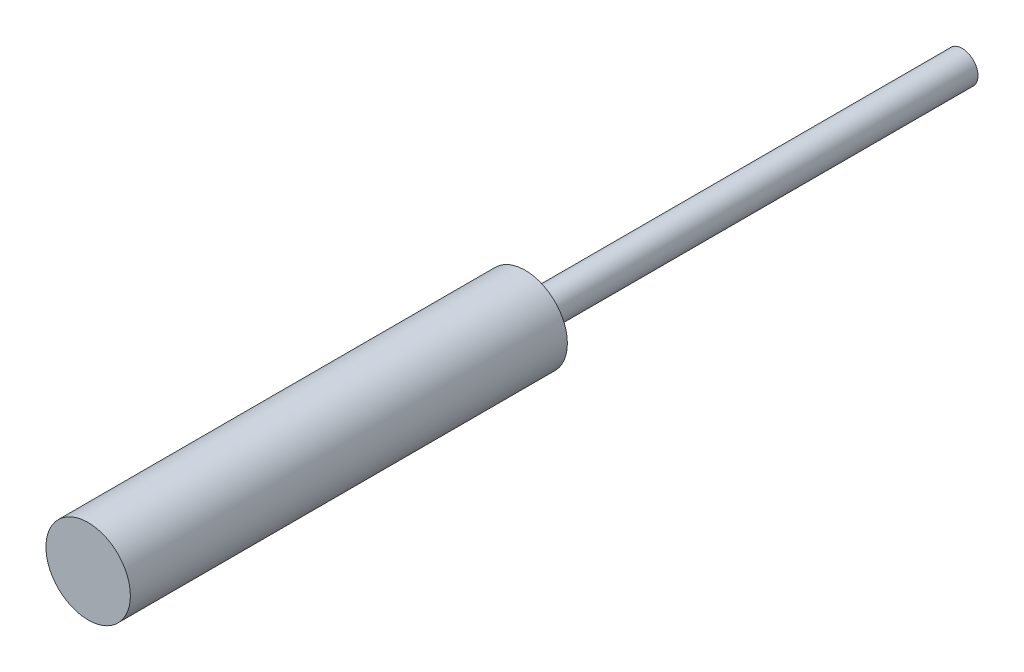
ISO-10303-21;
HEADER;
FILE_DESCRIPTION(('STEP AP214'),'2;1');
FILE_NAME('part.step','',(''),(''),'','','');
FILE_SCHEMA(('AUTOMOTIVE_DESIGN { 1 0 10303 214 1 1 1 1 }'));
ENDSEC;
DATA;
#1=APPLICATION_CONTEXT('core data for automotive mechanical design processes');
#2=APPLICATION_PROTOCOL_DEFINITION('international standard','automotive_design',2000,#1);
#3=PRODUCT_CONTEXT('',#1,'mechanical');
#4=PRODUCT('Part','Part','',(#3));
#5=PRODUCT_RELATED_PRODUCT_CATEGORY('part','',(#4));
#6=PRODUCT_DEFINITION_FORMATION('','',#4);
#7=PRODUCT_DEFINITION_CONTEXT('part definition',#1,'design');
#8=PRODUCT_DEFINITION('design','',#6,#7);
#9=PRODUCT_DEFINITION_SHAPE('','',#8);
#10=(LENGTH_UNIT() NAMED_UNIT(*) SI_UNIT(.MILLI.,.METRE.));
#11=(NAMED_UNIT(*) PLANE_ANGLE_UNIT() SI_UNIT($,.RADIAN.));
#12=(NAMED_UNIT(*) SI_UNIT($,.STERADIAN.) SOLID_ANGLE_UNIT());
#13=UNCERTAINTY_MEASURE_WITH_UNIT(LENGTH_MEASURE(1.E-05),#10,'distance_accuracy_value','');
#14=(GEOMETRIC_REPRESENTATION_CONTEXT(3) GLOBAL_UNCERTAINTY_ASSIGNED_CONTEXT((#13)) GLOBAL_UNIT_ASSIGNED_CONTEXT((#10,
#11,#12)) REPRESENTATION_CONTEXT('',''));
#15=CARTESIAN_POINT('',(0.,0.,0.));
#16=DIRECTION('',(0.,0.,1.));
#17=DIRECTION('',(1.,0.,0.));
#18=AXIS2_PLACEMENT_3D('',#15,#16,#17);
#19=CARTESIAN_POINT('',(0.,0.,20.7));
#20=DIRECTION('',(0.,0.,-1.));
#21=DIRECTION('',(-1.,0.,0.));
#22=AXIS2_PLACEMENT_3D('',#19,#20,#21);
#23=CYLINDRICAL_SURFACE('',#22,2.);
#24=CARTESIAN_POINT('',(0.,0.,20.7));
#25=DIRECTION('',(0.,0.,1.));
#26=DIRECTION('',(1.,0.,0.));
#27=AXIS2_PLACEMENT_3D('',#24,#25,#26);
#28=CIRCLE('',#27,2.);
#29=CARTESIAN_POINT('',(2.,0.,20.7));
#30=VERTEX_POINT('',#29);
#31=EDGE_CURVE('E41',#30,#30,#28,.T.);
#32=ORIENTED_EDGE('',*,*,#31,.F.);
#33=EDGE_LOOP('',(#32));
#34=FACE_BOUND('',#33,.T.);
#35=CARTESIAN_POINT('',(0.,0.,0.));
#36=DIRECTION('',(0.,0.,1.));
#37=DIRECTION('',(1.,0.,0.));
#38=AXIS2_PLACEMENT_3D('',#35,#36,#37);
#39=CIRCLE('',#38,2.);
#40=CARTESIAN_POINT('',(2.,0.,0.));
#41=VERTEX_POINT('',#40);
#42=EDGE_CURVE('E45',#41,#41,#39,.T.);
#43=ORIENTED_EDGE('',*,*,#42,.T.);
#44=EDGE_LOOP('',(#43));
#45=FACE_BOUND('',#44,.T.);
#46=ADVANCED_FACE('F35',(#34,#45),#23,.T.);
#47=CARTESIAN_POINT('',(0.,0.,20.7));
#48=DIRECTION('',(0.,0.,1.));
#49=DIRECTION('',(1.,0.,0.));
#50=AXIS2_PLACEMENT_3D('',#47,#48,#49);
#51=PLANE('',#50);
#52=ORIENTED_EDGE('',*,*,#31,.T.);
#53=EDGE_LOOP('',(#52));
#54=FACE_BOUND('',#53,.T.);
#55=ADVANCED_FACE('F66',(#54),#51,.T.);
#56=CARTESIAN_POINT('',(0.,0.,0.));
#57=DIRECTION('',(0.,0.,1.));
#58=DIRECTION('',(1.,0.,0.));
#59=AXIS2_PLACEMENT_3D('',#56,#57,#58);
#60=PLANE('',#59);
#61=CARTESIAN_POINT('',(0.,0.,0.));
#62=DIRECTION('',(0.,0.,1.));
#63=DIRECTION('',(1.,0.,0.));
#64=AXIS2_PLACEMENT_3D('',#61,#62,#63);
#65=CIRCLE('',#64,0.75);
#66=CARTESIAN_POINT('',(0.75,0.,0.));
#67=VERTEX_POINT('',#66);
#68=EDGE_CURVE('E10',#67,#67,#65,.F.);
#69=ORIENTED_EDGE('',*,*,#68,.F.);
#70=EDGE_LOOP('',(#69));
#71=FACE_BOUND('',#70,.T.);
#72=ORIENTED_EDGE('',*,*,#42,.F.);
#73=EDGE_LOOP('',(#72));
#74=FACE_BOUND('',#73,.T.);
#75=ADVANCED_FACE('F59',(#71,#74),#60,.F.);
#76=CARTESIAN_POINT('',(0.,0.,-20.7));
#77=DIRECTION('',(0.,0.,1.));
#78=DIRECTION('',(1.,0.,0.));
#79=AXIS2_PLACEMENT_3D('',#76,#77,#78);
#80=CYLINDRICAL_SURFACE('',#79,0.75);
#81=CARTESIAN_POINT('',(0.,0.,-20.7));
#82=DIRECTION('',(0.,0.,-1.));
#83=DIRECTION('',(-1.,0.,0.));
#84=AXIS2_PLACEMENT_3D('',#81,#82,#83);
#85=CIRCLE('',#84,0.75);
#86=CARTESIAN_POINT('',(-0.75,0.,-20.7));
#87=VERTEX_POINT('',#86);
#88=EDGE_CURVE('E50',#87,#87,#85,.T.);
#89=ORIENTED_EDGE('',*,*,#88,.F.);
#90=EDGE_LOOP('',(#89));
#91=FACE_BOUND('',#90,.T.);
#92=ORIENTED_EDGE('',*,*,#68,.T.);
#93=EDGE_LOOP('',(#92));
#94=FACE_BOUND('',#93,.T.);
#95=ADVANCED_FACE('F57',(#91,#94),#80,.T.);
#96=CARTESIAN_POINT('',(0.,0.,-20.7));
#97=DIRECTION('',(0.,0.,-1.));
#98=DIRECTION('',(-1.,0.,0.));
#99=AXIS2_PLACEMENT_3D('',#96,#97,#98);
#100=PLANE('',#99);
#101=ORIENTED_EDGE('',*,*,#88,.T.);
#102=EDGE_LOOP('',(#101));
#103=FACE_BOUND('',#102,.T.);
#104=ADVANCED_FACE('F55',(#103),#100,.T.);
#105=CLOSED_SHELL('',(#46,#55,#75,#95,#104));
#106=MANIFOLD_SOLID_BREP('B2',#105);
#107=ADVANCED_BREP_SHAPE_REPRESENTATION('',(#18,#106),#14);
#108=SHAPE_DEFINITION_REPRESENTATION(#9,#107);
ENDSEC;
END-ISO-10303-21;
